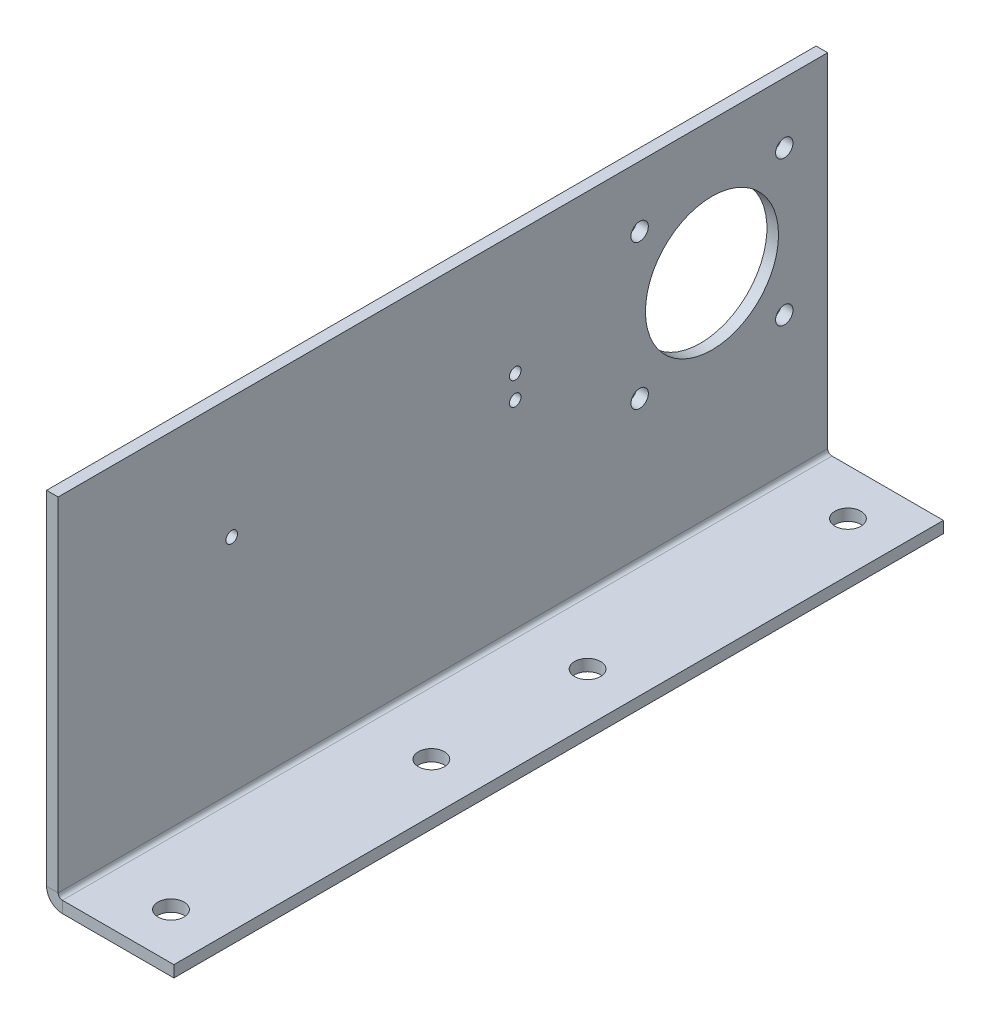
ISO-10303-21;
HEADER;
FILE_DESCRIPTION(('STEP AP214'),'2;1');
FILE_NAME('part.step','',(''),(''),'','','');
FILE_SCHEMA(('AUTOMOTIVE_DESIGN { 1 0 10303 214 1 1 1 1 }'));
ENDSEC;
DATA;
#1=APPLICATION_CONTEXT('core data for automotive mechanical design processes');
#2=APPLICATION_PROTOCOL_DEFINITION('international standard','automotive_design',2000,#1);
#3=PRODUCT_CONTEXT('',#1,'mechanical');
#4=PRODUCT('Part','Part','',(#3));
#5=PRODUCT_RELATED_PRODUCT_CATEGORY('part','',(#4));
#6=PRODUCT_DEFINITION_FORMATION('','',#4);
#7=PRODUCT_DEFINITION_CONTEXT('part definition',#1,'design');
#8=PRODUCT_DEFINITION('design','',#6,#7);
#9=PRODUCT_DEFINITION_SHAPE('','',#8);
#10=(LENGTH_UNIT() NAMED_UNIT(*) SI_UNIT(.MILLI.,.METRE.));
#11=(NAMED_UNIT(*) PLANE_ANGLE_UNIT() SI_UNIT($,.RADIAN.));
#12=(NAMED_UNIT(*) SI_UNIT($,.STERADIAN.) SOLID_ANGLE_UNIT());
#13=UNCERTAINTY_MEASURE_WITH_UNIT(LENGTH_MEASURE(1.E-05),#10,'distance_accuracy_value','');
#14=(GEOMETRIC_REPRESENTATION_CONTEXT(3) GLOBAL_UNCERTAINTY_ASSIGNED_CONTEXT((#13)) GLOBAL_UNIT_ASSIGNED_CONTEXT((#10,
#11,#12)) REPRESENTATION_CONTEXT('',''));
#15=CARTESIAN_POINT('',(0.,0.,0.));
#16=DIRECTION('',(0.,0.,1.));
#17=DIRECTION('',(1.,0.,0.));
#18=AXIS2_PLACEMENT_3D('',#15,#16,#17);
#19=CARTESIAN_POINT('',(0.,0.,133.));
#20=DIRECTION('',(1.,0.,0.));
#21=DIRECTION('',(0.,0.,-1.));
#22=AXIS2_PLACEMENT_3D('',#19,#20,#21);
#23=PLANE('',#22);
#24=CARTESIAN_POINT('',(0.,49.5,32.5));
#25=DIRECTION('',(1.,0.,0.));
#26=DIRECTION('',(0.,0.,-1.));
#27=AXIS2_PLACEMENT_3D('',#24,#25,#26);
#28=CIRCLE('',#27,1.5);
#29=CARTESIAN_POINT('',(0.,49.5,31.));
#30=VERTEX_POINT('',#29);
#31=EDGE_CURVE('E310',#30,#30,#28,.T.);
#32=ORIENTED_EDGE('',*,*,#31,.F.);
#33=EDGE_LOOP('',(#32));
#34=FACE_BOUND('',#33,.T.);
#35=CARTESIAN_POINT('',(0.,24.5,32.5));
#36=DIRECTION('',(1.,0.,0.));
#37=DIRECTION('',(0.,0.,-1.));
#38=AXIS2_PLACEMENT_3D('',#35,#36,#37);
#39=CIRCLE('',#38,1.5);
#40=CARTESIAN_POINT('',(0.,24.5,31.));
#41=VERTEX_POINT('',#40);
#42=EDGE_CURVE('E304',#41,#41,#39,.T.);
#43=ORIENTED_EDGE('',*,*,#42,.F.);
#44=EDGE_LOOP('',(#43));
#45=FACE_BOUND('',#44,.T.);
#46=CARTESIAN_POINT('',(0.,49.5,7.49999999999999));
#47=DIRECTION('',(1.,0.,0.));
#48=DIRECTION('',(0.,0.,-1.));
#49=AXIS2_PLACEMENT_3D('',#46,#47,#48);
#50=CIRCLE('',#49,1.5);
#51=CARTESIAN_POINT('',(0.,49.5,5.99999999999998));
#52=VERTEX_POINT('',#51);
#53=EDGE_CURVE('E298',#52,#52,#50,.T.);
#54=ORIENTED_EDGE('',*,*,#53,.F.);
#55=EDGE_LOOP('',(#54));
#56=FACE_BOUND('',#55,.T.);
#57=CARTESIAN_POINT('',(0.,24.5,7.49999999999999));
#58=DIRECTION('',(1.,0.,0.));
#59=DIRECTION('',(0.,0.,-1.));
#60=AXIS2_PLACEMENT_3D('',#57,#58,#59);
#61=CIRCLE('',#60,1.5);
#62=CARTESIAN_POINT('',(0.,24.5,5.99999999999999));
#63=VERTEX_POINT('',#62);
#64=EDGE_CURVE('E290',#63,#63,#61,.T.);
#65=ORIENTED_EDGE('',*,*,#64,.F.);
#66=EDGE_LOOP('',(#65));
#67=FACE_BOUND('',#66,.T.);
#68=CARTESIAN_POINT('',(0.,37.,20.));
#69=DIRECTION('',(1.,0.,0.));
#70=DIRECTION('',(0.,0.,-1.));
#71=AXIS2_PLACEMENT_3D('',#68,#69,#70);
#72=CIRCLE('',#71,11.5);
#73=CARTESIAN_POINT('',(0.,37.,8.49999999999999));
#74=VERTEX_POINT('',#73);
#75=EDGE_CURVE('E286',#74,#74,#72,.F.);
#76=ORIENTED_EDGE('',*,*,#75,.T.);
#77=EDGE_LOOP('',(#76));
#78=FACE_BOUND('',#77,.T.);
#79=DIRECTION('',(0.,-1.,0.));
#80=VECTOR('',#79,1.);
#81=CARTESIAN_POINT('',(0.,0.,0.));
#82=LINE('',#81,#80);
#83=CARTESIAN_POINT('',(0.,60.,0.));
#84=VERTEX_POINT('',#83);
#85=CARTESIAN_POINT('',(0.,0.7366,0.));
#86=VERTEX_POINT('',#85);
#87=EDGE_CURVE('E165',#84,#86,#82,.T.);
#88=ORIENTED_EDGE('',*,*,#87,.F.);
#89=DIRECTION('',(0.,0.,-1.));
#90=VECTOR('',#89,1.);
#91=CARTESIAN_POINT('',(0.,60.,133.));
#92=LINE('',#91,#90);
#93=CARTESIAN_POINT('',(0.,60.,133.));
#94=VERTEX_POINT('',#93);
#95=EDGE_CURVE('E129',#94,#84,#92,.T.);
#96=ORIENTED_EDGE('',*,*,#95,.F.);
#97=DIRECTION('',(0.,-1.,0.));
#98=VECTOR('',#97,1.);
#99=CARTESIAN_POINT('',(0.,0.,133.));
#100=LINE('',#99,#98);
#101=CARTESIAN_POINT('',(0.,0.7366,133.));
#102=VERTEX_POINT('',#101);
#103=EDGE_CURVE('E145',#94,#102,#100,.T.);
#104=ORIENTED_EDGE('',*,*,#103,.T.);
#105=DIRECTION('',(0.,0.,-1.));
#106=VECTOR('',#105,1.);
#107=CARTESIAN_POINT('',(0.,0.7366,133.));
#108=LINE('',#107,#106);
#109=EDGE_CURVE('E176',#102,#86,#108,.T.);
#110=ORIENTED_EDGE('',*,*,#109,.T.);
#111=EDGE_LOOP('',(#88,#96,#104,#110));
#112=FACE_BOUND('',#111,.T.);
#113=CARTESIAN_POINT('',(0.,39.,103.));
#114=DIRECTION('',(1.,0.,0.));
#115=DIRECTION('',(0.,0.,-1.));
#116=AXIS2_PLACEMENT_3D('',#113,#114,#115);
#117=CIRCLE('',#116,0.999999999999998);
#118=CARTESIAN_POINT('',(0.,39.,102.));
#119=VERTEX_POINT('',#118);
#120=EDGE_CURVE('E269',#119,#119,#117,.F.);
#121=ORIENTED_EDGE('',*,*,#120,.T.);
#122=EDGE_LOOP('',(#121));
#123=FACE_BOUND('',#122,.T.);
#124=CARTESIAN_POINT('',(0.,39.,54.));
#125=DIRECTION('',(1.,0.,0.));
#126=DIRECTION('',(0.,0.,-1.));
#127=AXIS2_PLACEMENT_3D('',#124,#125,#126);
#128=CIRCLE('',#127,0.999999999999998);
#129=CARTESIAN_POINT('',(0.,39.,53.));
#130=VERTEX_POINT('',#129);
#131=EDGE_CURVE('E272',#130,#130,#128,.F.);
#132=ORIENTED_EDGE('',*,*,#131,.T.);
#133=EDGE_LOOP('',(#132));
#134=FACE_BOUND('',#133,.T.);
#135=CARTESIAN_POINT('',(0.,35.,54.));
#136=DIRECTION('',(1.,0.,0.));
#137=DIRECTION('',(0.,0.,-1.));
#138=AXIS2_PLACEMENT_3D('',#135,#136,#137);
#139=CIRCLE('',#138,0.999999999999998);
#140=CARTESIAN_POINT('',(0.,35.,53.));
#141=VERTEX_POINT('',#140);
#142=EDGE_CURVE('E283',#141,#141,#139,.T.);
#143=ORIENTED_EDGE('',*,*,#142,.F.);
#144=EDGE_LOOP('',(#143));
#145=FACE_BOUND('',#144,.T.);
#146=ADVANCED_FACE('F48',(#34,#45,#56,#67,#78,#112,#123,#134,#145),#23,.T.);
#147=CARTESIAN_POINT('',(-2.,0.,133.));
#148=DIRECTION('',(1.,0.,0.));
#149=DIRECTION('',(0.,0.,-1.));
#150=AXIS2_PLACEMENT_3D('',#147,#148,#149);
#151=PLANE('',#150);
#152=CARTESIAN_POINT('',(-2.,49.5,32.5));
#153=DIRECTION('',(-1.,0.,0.));
#154=DIRECTION('',(0.,0.,1.));
#155=AXIS2_PLACEMENT_3D('',#152,#153,#154);
#156=CIRCLE('',#155,1.5);
#157=CARTESIAN_POINT('',(-2.,49.5,34.));
#158=VERTEX_POINT('',#157);
#159=EDGE_CURVE('E313',#158,#158,#156,.T.);
#160=ORIENTED_EDGE('',*,*,#159,.F.);
#161=EDGE_LOOP('',(#160));
#162=FACE_BOUND('',#161,.T.);
#163=CARTESIAN_POINT('',(-2.,24.5,32.5));
#164=DIRECTION('',(-1.,0.,0.));
#165=DIRECTION('',(0.,0.,1.));
#166=AXIS2_PLACEMENT_3D('',#163,#164,#165);
#167=CIRCLE('',#166,1.5);
#168=CARTESIAN_POINT('',(-2.,24.5,34.));
#169=VERTEX_POINT('',#168);
#170=EDGE_CURVE('E307',#169,#169,#167,.T.);
#171=ORIENTED_EDGE('',*,*,#170,.F.);
#172=EDGE_LOOP('',(#171));
#173=FACE_BOUND('',#172,.T.);
#174=CARTESIAN_POINT('',(-2.,49.5,7.49999999999999));
#175=DIRECTION('',(-1.,0.,0.));
#176=DIRECTION('',(0.,0.,1.));
#177=AXIS2_PLACEMENT_3D('',#174,#175,#176);
#178=CIRCLE('',#177,1.5);
#179=CARTESIAN_POINT('',(-2.,49.5,8.99999999999999));
#180=VERTEX_POINT('',#179);
#181=EDGE_CURVE('E301',#180,#180,#178,.T.);
#182=ORIENTED_EDGE('',*,*,#181,.F.);
#183=EDGE_LOOP('',(#182));
#184=FACE_BOUND('',#183,.T.);
#185=CARTESIAN_POINT('',(-2.,24.5,7.49999999999999));
#186=DIRECTION('',(-1.,0.,0.));
#187=DIRECTION('',(0.,0.,1.));
#188=AXIS2_PLACEMENT_3D('',#185,#186,#187);
#189=CIRCLE('',#188,1.5);
#190=CARTESIAN_POINT('',(-2.,24.5,8.99999999999998));
#191=VERTEX_POINT('',#190);
#192=EDGE_CURVE('E295',#191,#191,#189,.T.);
#193=ORIENTED_EDGE('',*,*,#192,.F.);
#194=EDGE_LOOP('',(#193));
#195=FACE_BOUND('',#194,.T.);
#196=CARTESIAN_POINT('',(-2.,37.,20.));
#197=DIRECTION('',(-1.,0.,0.));
#198=DIRECTION('',(0.,0.,1.));
#199=AXIS2_PLACEMENT_3D('',#196,#197,#198);
#200=CIRCLE('',#199,11.5);
#201=CARTESIAN_POINT('',(-2.,37.,31.5));
#202=VERTEX_POINT('',#201);
#203=EDGE_CURVE('E287',#202,#202,#200,.T.);
#204=ORIENTED_EDGE('',*,*,#203,.F.);
#205=EDGE_LOOP('',(#204));
#206=FACE_BOUND('',#205,.T.);
#207=DIRECTION('',(0.,1.,0.));
#208=VECTOR('',#207,1.);
#209=CARTESIAN_POINT('',(-2.,0.,0.));
#210=LINE('',#209,#208);
#211=CARTESIAN_POINT('',(-2.,60.,0.));
#212=VERTEX_POINT('',#211);
#213=CARTESIAN_POINT('',(-2.,0.7366,0.));
#214=VERTEX_POINT('',#213);
#215=EDGE_CURVE('E168',#212,#214,#210,.F.);
#216=ORIENTED_EDGE('',*,*,#215,.T.);
#217=DIRECTION('',(0.,0.,-1.));
#218=VECTOR('',#217,1.);
#219=CARTESIAN_POINT('',(-2.,0.7366,133.));
#220=LINE('',#219,#218);
#221=CARTESIAN_POINT('',(-2.,0.7366,133.));
#222=VERTEX_POINT('',#221);
#223=EDGE_CURVE('E130',#222,#214,#220,.T.);
#224=ORIENTED_EDGE('',*,*,#223,.F.);
#225=DIRECTION('',(0.,1.,0.));
#226=VECTOR('',#225,1.);
#227=CARTESIAN_POINT('',(-2.,0.,133.));
#228=LINE('',#227,#226);
#229=CARTESIAN_POINT('',(-2.,60.,133.));
#230=VERTEX_POINT('',#229);
#231=EDGE_CURVE('E134',#230,#222,#228,.F.);
#232=ORIENTED_EDGE('',*,*,#231,.F.);
#233=DIRECTION('',(0.,0.,-1.));
#234=VECTOR('',#233,1.);
#235=CARTESIAN_POINT('',(-2.,60.,133.));
#236=LINE('',#235,#234);
#237=EDGE_CURVE('E121',#230,#212,#236,.T.);
#238=ORIENTED_EDGE('',*,*,#237,.T.);
#239=EDGE_LOOP('',(#216,#224,#232,#238));
#240=FACE_BOUND('',#239,.T.);
#241=CARTESIAN_POINT('',(-2.,39.,103.));
#242=DIRECTION('',(-1.,0.,0.));
#243=DIRECTION('',(0.,0.,1.));
#244=AXIS2_PLACEMENT_3D('',#241,#242,#243);
#245=CIRCLE('',#244,0.999999999999998);
#246=CARTESIAN_POINT('',(-2.,39.,104.));
#247=VERTEX_POINT('',#246);
#248=EDGE_CURVE('E157',#247,#247,#245,.T.);
#249=ORIENTED_EDGE('',*,*,#248,.F.);
#250=EDGE_LOOP('',(#249));
#251=FACE_BOUND('',#250,.T.);
#252=CARTESIAN_POINT('',(-2.,39.,54.));
#253=DIRECTION('',(-1.,0.,0.));
#254=DIRECTION('',(0.,0.,1.));
#255=AXIS2_PLACEMENT_3D('',#252,#253,#254);
#256=CIRCLE('',#255,0.999999999999998);
#257=CARTESIAN_POINT('',(-2.,39.,55.));
#258=VERTEX_POINT('',#257);
#259=EDGE_CURVE('E275',#258,#258,#256,.T.);
#260=ORIENTED_EDGE('',*,*,#259,.F.);
#261=EDGE_LOOP('',(#260));
#262=FACE_BOUND('',#261,.T.);
#263=CARTESIAN_POINT('',(-2.,35.,54.));
#264=DIRECTION('',(-1.,0.,0.));
#265=DIRECTION('',(0.,0.,1.));
#266=AXIS2_PLACEMENT_3D('',#263,#264,#265);
#267=CIRCLE('',#266,0.999999999999998);
#268=CARTESIAN_POINT('',(-2.,35.,55.));
#269=VERTEX_POINT('',#268);
#270=EDGE_CURVE('E278',#269,#269,#267,.F.);
#271=ORIENTED_EDGE('',*,*,#270,.T.);
#272=EDGE_LOOP('',(#271));
#273=FACE_BOUND('',#272,.T.);
#274=ADVANCED_FACE('F135',(#162,#173,#184,#195,#206,#240,#251,#262,#273),#151,.F.);
#275=CARTESIAN_POINT('',(0.7366,0.,133.));
#276=DIRECTION('',(0.,0.,1.));
#277=DIRECTION('',(1.,0.,0.));
#278=AXIS2_PLACEMENT_3D('',#275,#276,#277);
#279=PLANE('',#278);
#280=DIRECTION('',(0.,-1.,0.));
#281=VECTOR('',#280,1.);
#282=CARTESIAN_POINT('',(0.7366,0.,133.));
#283=LINE('',#282,#281);
#284=CARTESIAN_POINT('',(0.7366,0.,133.));
#285=VERTEX_POINT('',#284);
#286=CARTESIAN_POINT('',(0.7366,-2.,133.));
#287=VERTEX_POINT('',#286);
#288=EDGE_CURVE('E13',#285,#287,#283,.T.);
#289=ORIENTED_EDGE('',*,*,#288,.F.);
#290=CARTESIAN_POINT('',(0.7366,0.7366,133.));
#291=DIRECTION('',(0.,0.,-1.));
#292=DIRECTION('',(-1.,0.,0.));
#293=AXIS2_PLACEMENT_3D('',#290,#291,#292);
#294=CIRCLE('',#293,0.7366);
#295=EDGE_CURVE('E147',#102,#285,#294,.F.);
#296=ORIENTED_EDGE('',*,*,#295,.F.);
#297=DIRECTION('',(1.,0.,0.));
#298=VECTOR('',#297,1.);
#299=CARTESIAN_POINT('',(-2.,0.7366,133.));
#300=LINE('',#299,#298);
#301=EDGE_CURVE('E57',#222,#102,#300,.T.);
#302=ORIENTED_EDGE('',*,*,#301,.F.);
#303=CARTESIAN_POINT('',(0.7366,0.7366,133.));
#304=DIRECTION('',(0.,0.,1.));
#305=DIRECTION('',(1.,0.,0.));
#306=AXIS2_PLACEMENT_3D('',#303,#304,#305);
#307=CIRCLE('',#306,2.7366);
#308=EDGE_CURVE('E140',#222,#287,#307,.T.);
#309=ORIENTED_EDGE('',*,*,#308,.T.);
#310=EDGE_LOOP('',(#289,#296,#302,#309));
#311=FACE_BOUND('',#310,.T.);
#312=ADVANCED_FACE('F50',(#311),#279,.T.);
#313=CARTESIAN_POINT('',(-2.,0.7366,133.));
#314=DIRECTION('',(0.,0.,1.));
#315=DIRECTION('',(1.,0.,0.));
#316=AXIS2_PLACEMENT_3D('',#313,#314,#315);
#317=PLANE('',#316);
#318=DIRECTION('',(1.,0.,0.));
#319=VECTOR('',#318,1.);
#320=CARTESIAN_POINT('',(0.,0.,133.));
#321=LINE('',#320,#319);
#322=CARTESIAN_POINT('',(20.,0.,133.));
#323=VERTEX_POINT('',#322);
#324=EDGE_CURVE('E197',#285,#323,#321,.T.);
#325=ORIENTED_EDGE('',*,*,#324,.F.);
#326=ORIENTED_EDGE('',*,*,#288,.T.);
#327=DIRECTION('',(1.,0.,0.));
#328=VECTOR('',#327,1.);
#329=CARTESIAN_POINT('',(0.,-2.,133.));
#330=LINE('',#329,#328);
#331=CARTESIAN_POINT('',(20.,-2.,133.));
#332=VERTEX_POINT('',#331);
#333=EDGE_CURVE('E105',#287,#332,#330,.T.);
#334=ORIENTED_EDGE('',*,*,#333,.T.);
#335=DIRECTION('',(0.,-1.,0.));
#336=VECTOR('',#335,1.);
#337=CARTESIAN_POINT('',(20.,0.,133.));
#338=LINE('',#337,#336);
#339=EDGE_CURVE('E263',#323,#332,#338,.T.);
#340=ORIENTED_EDGE('',*,*,#339,.F.);
#341=EDGE_LOOP('',(#325,#326,#334,#340));
#342=FACE_BOUND('',#341,.T.);
#343=ADVANCED_FACE('F205',(#342),#317,.T.);
#344=CARTESIAN_POINT('',(0.,0.7366,0.));
#345=DIRECTION('',(0.,0.,-1.));
#346=DIRECTION('',(-1.,0.,0.));
#347=AXIS2_PLACEMENT_3D('',#344,#345,#346);
#348=PLANE('',#347);
#349=DIRECTION('',(-1.,0.,0.));
#350=VECTOR('',#349,1.);
#351=CARTESIAN_POINT('',(0.,0.7366,0.));
#352=LINE('',#351,#350);
#353=EDGE_CURVE('E92',#86,#214,#352,.T.);
#354=ORIENTED_EDGE('',*,*,#353,.F.);
#355=CARTESIAN_POINT('',(0.7366,0.7366,0.));
#356=DIRECTION('',(0.,0.,-1.));
#357=DIRECTION('',(-1.,0.,0.));
#358=AXIS2_PLACEMENT_3D('',#355,#356,#357);
#359=CIRCLE('',#358,0.7366);
#360=CARTESIAN_POINT('',(0.7366,0.,0.));
#361=VERTEX_POINT('',#360);
#362=EDGE_CURVE('E163',#86,#361,#359,.F.);
#363=ORIENTED_EDGE('',*,*,#362,.T.);
#364=DIRECTION('',(0.,1.,0.));
#365=VECTOR('',#364,1.);
#366=CARTESIAN_POINT('',(0.7366,-2.,0.));
#367=LINE('',#366,#365);
#368=CARTESIAN_POINT('',(0.7366,-2.,0.));
#369=VERTEX_POINT('',#368);
#370=EDGE_CURVE('E99',#369,#361,#367,.T.);
#371=ORIENTED_EDGE('',*,*,#370,.F.);
#372=CARTESIAN_POINT('',(0.7366,0.7366,0.));
#373=DIRECTION('',(0.,0.,1.));
#374=DIRECTION('',(1.,0.,0.));
#375=AXIS2_PLACEMENT_3D('',#372,#373,#374);
#376=CIRCLE('',#375,2.7366);
#377=EDGE_CURVE('E170',#214,#369,#376,.T.);
#378=ORIENTED_EDGE('',*,*,#377,.F.);
#379=EDGE_LOOP('',(#354,#363,#371,#378));
#380=FACE_BOUND('',#379,.T.);
#381=ADVANCED_FACE('F203',(#380),#348,.T.);
#382=CARTESIAN_POINT('',(0.7366,-2.,0.));
#383=DIRECTION('',(0.,0.,-1.));
#384=DIRECTION('',(-1.,0.,0.));
#385=AXIS2_PLACEMENT_3D('',#382,#383,#384);
#386=PLANE('',#385);
#387=ORIENTED_EDGE('',*,*,#87,.T.);
#388=ORIENTED_EDGE('',*,*,#353,.T.);
#389=ORIENTED_EDGE('',*,*,#215,.F.);
#390=DIRECTION('',(1.,0.,0.));
#391=VECTOR('',#390,1.);
#392=CARTESIAN_POINT('',(-2.,60.,0.));
#393=LINE('',#392,#391);
#394=EDGE_CURVE('E127',#212,#84,#393,.T.);
#395=ORIENTED_EDGE('',*,*,#394,.T.);
#396=EDGE_LOOP('',(#387,#388,#389,#395));
#397=FACE_BOUND('',#396,.T.);
#398=ADVANCED_FACE('F199',(#397),#386,.T.);
#399=CARTESIAN_POINT('',(0.,-2.,133.));
#400=DIRECTION('',(0.,1.,0.));
#401=DIRECTION('',(0.,0.,1.));
#402=AXIS2_PLACEMENT_3D('',#399,#400,#401);
#403=PLANE('',#402);
#404=CARTESIAN_POINT('',(11.5,-2.,8.));
#405=DIRECTION('',(0.,1.,0.));
#406=DIRECTION('',(0.,0.,1.));
#407=AXIS2_PLACEMENT_3D('',#404,#405,#406);
#408=CIRCLE('',#407,2.25);
#409=CARTESIAN_POINT('',(11.5,-2.,10.25));
#410=VERTEX_POINT('',#409);
#411=EDGE_CURVE('E244',#410,#410,#408,.T.);
#412=ORIENTED_EDGE('',*,*,#411,.T.);
#413=EDGE_LOOP('',(#412));
#414=FACE_BOUND('',#413,.T.);
#415=CARTESIAN_POINT('',(11.5,-2.,53.));
#416=DIRECTION('',(0.,1.,0.));
#417=DIRECTION('',(0.,0.,1.));
#418=AXIS2_PLACEMENT_3D('',#415,#416,#417);
#419=CIRCLE('',#418,2.25);
#420=CARTESIAN_POINT('',(11.5,-2.,55.25));
#421=VERTEX_POINT('',#420);
#422=EDGE_CURVE('E248',#421,#421,#419,.T.);
#423=ORIENTED_EDGE('',*,*,#422,.T.);
#424=EDGE_LOOP('',(#423));
#425=FACE_BOUND('',#424,.T.);
#426=CARTESIAN_POINT('',(11.5,-2.,80.));
#427=DIRECTION('',(0.,1.,0.));
#428=DIRECTION('',(0.,0.,1.));
#429=AXIS2_PLACEMENT_3D('',#426,#427,#428);
#430=CIRCLE('',#429,2.25);
#431=CARTESIAN_POINT('',(11.5,-2.,82.25));
#432=VERTEX_POINT('',#431);
#433=EDGE_CURVE('E252',#432,#432,#430,.T.);
#434=ORIENTED_EDGE('',*,*,#433,.T.);
#435=EDGE_LOOP('',(#434));
#436=FACE_BOUND('',#435,.T.);
#437=CARTESIAN_POINT('',(11.5,-2.,125.));
#438=DIRECTION('',(0.,1.,0.));
#439=DIRECTION('',(0.,0.,1.));
#440=AXIS2_PLACEMENT_3D('',#437,#438,#439);
#441=CIRCLE('',#440,2.25);
#442=CARTESIAN_POINT('',(11.5,-2.,127.25));
#443=VERTEX_POINT('',#442);
#444=EDGE_CURVE('E256',#443,#443,#441,.T.);
#445=ORIENTED_EDGE('',*,*,#444,.T.);
#446=EDGE_LOOP('',(#445));
#447=FACE_BOUND('',#446,.T.);
#448=DIRECTION('',(1.,0.,0.));
#449=VECTOR('',#448,1.);
#450=CARTESIAN_POINT('',(0.,-2.,0.));
#451=LINE('',#450,#449);
#452=CARTESIAN_POINT('',(20.,-2.,0.));
#453=VERTEX_POINT('',#452);
#454=EDGE_CURVE('E153',#369,#453,#451,.T.);
#455=ORIENTED_EDGE('',*,*,#454,.T.);
#456=DIRECTION('',(0.,0.,-1.));
#457=VECTOR('',#456,1.);
#458=CARTESIAN_POINT('',(20.,-2.,133.));
#459=LINE('',#458,#457);
#460=EDGE_CURVE('E184',#332,#453,#459,.T.);
#461=ORIENTED_EDGE('',*,*,#460,.F.);
#462=ORIENTED_EDGE('',*,*,#333,.F.);
#463=DIRECTION('',(0.,0.,-1.));
#464=VECTOR('',#463,1.);
#465=CARTESIAN_POINT('',(0.7366,-2.,133.));
#466=LINE('',#465,#464);
#467=EDGE_CURVE('E152',#287,#369,#466,.T.);
#468=ORIENTED_EDGE('',*,*,#467,.T.);
#469=EDGE_LOOP('',(#455,#461,#462,#468));
#470=FACE_BOUND('',#469,.T.);
#471=ADVANCED_FACE('F211',(#414,#425,#436,#447,#470),#403,.F.);
#472=CARTESIAN_POINT('',(20.,0.,133.));
#473=DIRECTION('',(1.,0.,0.));
#474=DIRECTION('',(0.,0.,-1.));
#475=AXIS2_PLACEMENT_3D('',#472,#473,#474);
#476=PLANE('',#475);
#477=DIRECTION('',(0.,-1.,0.));
#478=VECTOR('',#477,1.);
#479=CARTESIAN_POINT('',(20.,0.,0.));
#480=LINE('',#479,#478);
#481=CARTESIAN_POINT('',(20.,0.,0.));
#482=VERTEX_POINT('',#481);
#483=EDGE_CURVE('E156',#482,#453,#480,.T.);
#484=ORIENTED_EDGE('',*,*,#483,.F.);
#485=DIRECTION('',(0.,0.,-1.));
#486=VECTOR('',#485,1.);
#487=CARTESIAN_POINT('',(20.,0.,133.));
#488=LINE('',#487,#486);
#489=EDGE_CURVE('E182',#323,#482,#488,.T.);
#490=ORIENTED_EDGE('',*,*,#489,.F.);
#491=ORIENTED_EDGE('',*,*,#339,.T.);
#492=ORIENTED_EDGE('',*,*,#460,.T.);
#493=EDGE_LOOP('',(#484,#490,#491,#492));
#494=FACE_BOUND('',#493,.T.);
#495=ADVANCED_FACE('F231',(#494),#476,.T.);
#496=CARTESIAN_POINT('',(0.,0.,133.));
#497=DIRECTION('',(0.,1.,0.));
#498=DIRECTION('',(0.,0.,1.));
#499=AXIS2_PLACEMENT_3D('',#496,#497,#498);
#500=PLANE('',#499);
#501=CARTESIAN_POINT('',(11.5,0.,8.));
#502=DIRECTION('',(0.,1.,0.));
#503=DIRECTION('',(0.,0.,1.));
#504=AXIS2_PLACEMENT_3D('',#501,#502,#503);
#505=CIRCLE('',#504,2.25);
#506=CARTESIAN_POINT('',(11.5,0.,10.25));
#507=VERTEX_POINT('',#506);
#508=EDGE_CURVE('E328',#507,#507,#505,.T.);
#509=ORIENTED_EDGE('',*,*,#508,.F.);
#510=EDGE_LOOP('',(#509));
#511=FACE_BOUND('',#510,.T.);
#512=CARTESIAN_POINT('',(11.5,0.,53.));
#513=DIRECTION('',(0.,1.,0.));
#514=DIRECTION('',(0.,0.,1.));
#515=AXIS2_PLACEMENT_3D('',#512,#513,#514);
#516=CIRCLE('',#515,2.25);
#517=CARTESIAN_POINT('',(11.5,0.,55.25));
#518=VERTEX_POINT('',#517);
#519=EDGE_CURVE('E324',#518,#518,#516,.T.);
#520=ORIENTED_EDGE('',*,*,#519,.F.);
#521=EDGE_LOOP('',(#520));
#522=FACE_BOUND('',#521,.T.);
#523=CARTESIAN_POINT('',(11.5,0.,80.));
#524=DIRECTION('',(0.,1.,0.));
#525=DIRECTION('',(0.,0.,1.));
#526=AXIS2_PLACEMENT_3D('',#523,#524,#525);
#527=CIRCLE('',#526,2.25);
#528=CARTESIAN_POINT('',(11.5,0.,82.25));
#529=VERTEX_POINT('',#528);
#530=EDGE_CURVE('E320',#529,#529,#527,.T.);
#531=ORIENTED_EDGE('',*,*,#530,.F.);
#532=EDGE_LOOP('',(#531));
#533=FACE_BOUND('',#532,.T.);
#534=CARTESIAN_POINT('',(11.5,0.,125.));
#535=DIRECTION('',(0.,1.,0.));
#536=DIRECTION('',(0.,0.,1.));
#537=AXIS2_PLACEMENT_3D('',#534,#535,#536);
#538=CIRCLE('',#537,2.25);
#539=CARTESIAN_POINT('',(11.5,0.,127.25));
#540=VERTEX_POINT('',#539);
#541=EDGE_CURVE('E316',#540,#540,#538,.T.);
#542=ORIENTED_EDGE('',*,*,#541,.F.);
#543=EDGE_LOOP('',(#542));
#544=FACE_BOUND('',#543,.T.);
#545=DIRECTION('',(1.,0.,0.));
#546=VECTOR('',#545,1.);
#547=CARTESIAN_POINT('',(0.,0.,0.));
#548=LINE('',#547,#546);
#549=EDGE_CURVE('E160',#361,#482,#548,.T.);
#550=ORIENTED_EDGE('',*,*,#549,.F.);
#551=DIRECTION('',(0.,0.,-1.));
#552=VECTOR('',#551,1.);
#553=CARTESIAN_POINT('',(0.7366,0.,133.));
#554=LINE('',#553,#552);
#555=EDGE_CURVE('E179',#285,#361,#554,.T.);
#556=ORIENTED_EDGE('',*,*,#555,.F.);
#557=ORIENTED_EDGE('',*,*,#324,.T.);
#558=ORIENTED_EDGE('',*,*,#489,.T.);
#559=EDGE_LOOP('',(#550,#556,#557,#558));
#560=FACE_BOUND('',#559,.T.);
#561=ADVANCED_FACE('F228',(#511,#522,#533,#544,#560),#500,.T.);
#562=CARTESIAN_POINT('',(0.7366,0.7366,133.));
#563=DIRECTION('',(0.,0.,-1.));
#564=DIRECTION('',(-1.,0.,0.));
#565=AXIS2_PLACEMENT_3D('',#562,#563,#564);
#566=CYLINDRICAL_SURFACE('',#565,0.7366);
#567=ORIENTED_EDGE('',*,*,#362,.F.);
#568=ORIENTED_EDGE('',*,*,#109,.F.);
#569=ORIENTED_EDGE('',*,*,#295,.T.);
#570=ORIENTED_EDGE('',*,*,#555,.T.);
#571=EDGE_LOOP('',(#567,#568,#569,#570));
#572=FACE_BOUND('',#571,.T.);
#573=ADVANCED_FACE('F193',(#572),#566,.F.);
#574=CARTESIAN_POINT('',(-2.,60.,133.));
#575=DIRECTION('',(0.,1.,0.));
#576=DIRECTION('',(0.,0.,1.));
#577=AXIS2_PLACEMENT_3D('',#574,#575,#576);
#578=PLANE('',#577);
#579=ORIENTED_EDGE('',*,*,#394,.F.);
#580=ORIENTED_EDGE('',*,*,#237,.F.);
#581=DIRECTION('',(1.,0.,0.));
#582=VECTOR('',#581,1.);
#583=CARTESIAN_POINT('',(-2.,60.,133.));
#584=LINE('',#583,#582);
#585=EDGE_CURVE('E125',#230,#94,#584,.T.);
#586=ORIENTED_EDGE('',*,*,#585,.T.);
#587=ORIENTED_EDGE('',*,*,#95,.T.);
#588=EDGE_LOOP('',(#579,#580,#586,#587));
#589=FACE_BOUND('',#588,.T.);
#590=ADVANCED_FACE('F123',(#589),#578,.T.);
#591=CARTESIAN_POINT('',(0.7366,0.7366,133.));
#592=DIRECTION('',(0.,0.,-1.));
#593=DIRECTION('',(-1.,0.,0.));
#594=AXIS2_PLACEMENT_3D('',#591,#592,#593);
#595=CYLINDRICAL_SURFACE('',#594,2.7366);
#596=ORIENTED_EDGE('',*,*,#377,.T.);
#597=ORIENTED_EDGE('',*,*,#467,.F.);
#598=ORIENTED_EDGE('',*,*,#308,.F.);
#599=ORIENTED_EDGE('',*,*,#223,.T.);
#600=EDGE_LOOP('',(#596,#597,#598,#599));
#601=FACE_BOUND('',#600,.T.);
#602=ADVANCED_FACE('F201',(#601),#595,.T.);
#603=CARTESIAN_POINT('',(0.7366,0.7366,133.));
#604=DIRECTION('',(0.,0.,-1.));
#605=DIRECTION('',(-1.,0.,0.));
#606=AXIS2_PLACEMENT_3D('',#603,#604,#605);
#607=PLANE('',#606);
#608=ORIENTED_EDGE('',*,*,#231,.T.);
#609=ORIENTED_EDGE('',*,*,#301,.T.);
#610=ORIENTED_EDGE('',*,*,#103,.F.);
#611=ORIENTED_EDGE('',*,*,#585,.F.);
#612=EDGE_LOOP('',(#608,#609,#610,#611));
#613=FACE_BOUND('',#612,.T.);
#614=ADVANCED_FACE('F143',(#613),#607,.F.);
#615=CARTESIAN_POINT('',(0.7366,0.7366,0.));
#616=DIRECTION('',(0.,0.,-1.));
#617=DIRECTION('',(-1.,0.,0.));
#618=AXIS2_PLACEMENT_3D('',#615,#616,#617);
#619=PLANE('',#618);
#620=ORIENTED_EDGE('',*,*,#454,.F.);
#621=ORIENTED_EDGE('',*,*,#370,.T.);
#622=ORIENTED_EDGE('',*,*,#549,.T.);
#623=ORIENTED_EDGE('',*,*,#483,.T.);
#624=EDGE_LOOP('',(#620,#621,#622,#623));
#625=FACE_BOUND('',#624,.T.);
#626=ADVANCED_FACE('F261',(#625),#619,.T.);
#627=CARTESIAN_POINT('',(20.001,39.,103.));
#628=DIRECTION('',(-1.,0.,0.));
#629=DIRECTION('',(0.,0.,1.));
#630=AXIS2_PLACEMENT_3D('',#627,#628,#629);
#631=CYLINDRICAL_SURFACE('',#630,0.999999999999998);
#632=ORIENTED_EDGE('',*,*,#120,.F.);
#633=EDGE_LOOP('',(#632));
#634=FACE_BOUND('',#633,.T.);
#635=ORIENTED_EDGE('',*,*,#248,.T.);
#636=EDGE_LOOP('',(#635));
#637=FACE_BOUND('',#636,.T.);
#638=ADVANCED_FACE('F382',(#634,#637),#631,.F.);
#639=CARTESIAN_POINT('',(20.001,39.,54.));
#640=DIRECTION('',(-1.,0.,0.));
#641=DIRECTION('',(0.,0.,1.));
#642=AXIS2_PLACEMENT_3D('',#639,#640,#641);
#643=CYLINDRICAL_SURFACE('',#642,0.999999999999998);
#644=ORIENTED_EDGE('',*,*,#131,.F.);
#645=EDGE_LOOP('',(#644));
#646=FACE_BOUND('',#645,.T.);
#647=ORIENTED_EDGE('',*,*,#259,.T.);
#648=EDGE_LOOP('',(#647));
#649=FACE_BOUND('',#648,.T.);
#650=ADVANCED_FACE('F378',(#646,#649),#643,.F.);
#651=CARTESIAN_POINT('',(20.001,35.,54.));
#652=DIRECTION('',(-1.,0.,0.));
#653=DIRECTION('',(0.,0.,1.));
#654=AXIS2_PLACEMENT_3D('',#651,#652,#653);
#655=CYLINDRICAL_SURFACE('',#654,0.999999999999998);
#656=ORIENTED_EDGE('',*,*,#142,.T.);
#657=EDGE_LOOP('',(#656));
#658=FACE_BOUND('',#657,.T.);
#659=ORIENTED_EDGE('',*,*,#270,.F.);
#660=EDGE_LOOP('',(#659));
#661=FACE_BOUND('',#660,.T.);
#662=ADVANCED_FACE('F374',(#658,#661),#655,.F.);
#663=CARTESIAN_POINT('',(20.001,37.,20.));
#664=DIRECTION('',(-1.,0.,0.));
#665=DIRECTION('',(0.,0.,1.));
#666=AXIS2_PLACEMENT_3D('',#663,#664,#665);
#667=CYLINDRICAL_SURFACE('',#666,11.5);
#668=ORIENTED_EDGE('',*,*,#75,.F.);
#669=EDGE_LOOP('',(#668));
#670=FACE_BOUND('',#669,.T.);
#671=ORIENTED_EDGE('',*,*,#203,.T.);
#672=EDGE_LOOP('',(#671));
#673=FACE_BOUND('',#672,.T.);
#674=ADVANCED_FACE('F370',(#670,#673),#667,.F.);
#675=CARTESIAN_POINT('',(-2.,24.5,7.49999999999999));
#676=DIRECTION('',(-1.,0.,0.));
#677=DIRECTION('',(0.,0.,1.));
#678=AXIS2_PLACEMENT_3D('',#675,#676,#677);
#679=CYLINDRICAL_SURFACE('',#678,1.5);
#680=ORIENTED_EDGE('',*,*,#64,.T.);
#681=EDGE_LOOP('',(#680));
#682=FACE_BOUND('',#681,.T.);
#683=ORIENTED_EDGE('',*,*,#192,.T.);
#684=EDGE_LOOP('',(#683));
#685=FACE_BOUND('',#684,.T.);
#686=ADVANCED_FACE('F366',(#682,#685),#679,.F.);
#687=CARTESIAN_POINT('',(-2.,49.5,7.49999999999999));
#688=DIRECTION('',(-1.,0.,0.));
#689=DIRECTION('',(0.,0.,1.));
#690=AXIS2_PLACEMENT_3D('',#687,#688,#689);
#691=CYLINDRICAL_SURFACE('',#690,1.5);
#692=ORIENTED_EDGE('',*,*,#53,.T.);
#693=EDGE_LOOP('',(#692));
#694=FACE_BOUND('',#693,.T.);
#695=ORIENTED_EDGE('',*,*,#181,.T.);
#696=EDGE_LOOP('',(#695));
#697=FACE_BOUND('',#696,.T.);
#698=ADVANCED_FACE('F362',(#694,#697),#691,.F.);
#699=CARTESIAN_POINT('',(-2.,24.5,32.5));
#700=DIRECTION('',(-1.,0.,0.));
#701=DIRECTION('',(0.,0.,1.));
#702=AXIS2_PLACEMENT_3D('',#699,#700,#701);
#703=CYLINDRICAL_SURFACE('',#702,1.5);
#704=ORIENTED_EDGE('',*,*,#42,.T.);
#705=EDGE_LOOP('',(#704));
#706=FACE_BOUND('',#705,.T.);
#707=ORIENTED_EDGE('',*,*,#170,.T.);
#708=EDGE_LOOP('',(#707));
#709=FACE_BOUND('',#708,.T.);
#710=ADVANCED_FACE('F355',(#706,#709),#703,.F.);
#711=CARTESIAN_POINT('',(-2.,49.5,32.5));
#712=DIRECTION('',(-1.,0.,0.));
#713=DIRECTION('',(0.,0.,1.));
#714=AXIS2_PLACEMENT_3D('',#711,#712,#713);
#715=CYLINDRICAL_SURFACE('',#714,1.5);
#716=ORIENTED_EDGE('',*,*,#31,.T.);
#717=EDGE_LOOP('',(#716));
#718=FACE_BOUND('',#717,.T.);
#719=ORIENTED_EDGE('',*,*,#159,.T.);
#720=EDGE_LOOP('',(#719));
#721=FACE_BOUND('',#720,.T.);
#722=ADVANCED_FACE('F345',(#718,#721),#715,.F.);
#723=CARTESIAN_POINT('',(11.5,-2.,125.));
#724=DIRECTION('',(0.,1.,0.));
#725=DIRECTION('',(0.,0.,1.));
#726=AXIS2_PLACEMENT_3D('',#723,#724,#725);
#727=CYLINDRICAL_SURFACE('',#726,2.25);
#728=ORIENTED_EDGE('',*,*,#444,.F.);
#729=EDGE_LOOP('',(#728));
#730=FACE_BOUND('',#729,.T.);
#731=ORIENTED_EDGE('',*,*,#541,.T.);
#732=EDGE_LOOP('',(#731));
#733=FACE_BOUND('',#732,.T.);
#734=ADVANCED_FACE('F342',(#730,#733),#727,.F.);
#735=CARTESIAN_POINT('',(11.5,-2.,80.));
#736=DIRECTION('',(0.,1.,0.));
#737=DIRECTION('',(0.,0.,1.));
#738=AXIS2_PLACEMENT_3D('',#735,#736,#737);
#739=CYLINDRICAL_SURFACE('',#738,2.25);
#740=ORIENTED_EDGE('',*,*,#433,.F.);
#741=EDGE_LOOP('',(#740));
#742=FACE_BOUND('',#741,.T.);
#743=ORIENTED_EDGE('',*,*,#530,.T.);
#744=EDGE_LOOP('',(#743));
#745=FACE_BOUND('',#744,.T.);
#746=ADVANCED_FACE('F344',(#742,#745),#739,.F.);
#747=CARTESIAN_POINT('',(11.5,-2.,53.));
#748=DIRECTION('',(0.,1.,0.));
#749=DIRECTION('',(0.,0.,1.));
#750=AXIS2_PLACEMENT_3D('',#747,#748,#749);
#751=CYLINDRICAL_SURFACE('',#750,2.25);
#752=ORIENTED_EDGE('',*,*,#422,.F.);
#753=EDGE_LOOP('',(#752));
#754=FACE_BOUND('',#753,.T.);
#755=ORIENTED_EDGE('',*,*,#519,.T.);
#756=EDGE_LOOP('',(#755));
#757=FACE_BOUND('',#756,.T.);
#758=ADVANCED_FACE('F352',(#754,#757),#751,.F.);
#759=CARTESIAN_POINT('',(11.5,-2.,8.));
#760=DIRECTION('',(0.,1.,0.));
#761=DIRECTION('',(0.,0.,1.));
#762=AXIS2_PLACEMENT_3D('',#759,#760,#761);
#763=CYLINDRICAL_SURFACE('',#762,2.25);
#764=ORIENTED_EDGE('',*,*,#411,.F.);
#765=EDGE_LOOP('',(#764));
#766=FACE_BOUND('',#765,.T.);
#767=ORIENTED_EDGE('',*,*,#508,.T.);
#768=EDGE_LOOP('',(#767));
#769=FACE_BOUND('',#768,.T.);
#770=ADVANCED_FACE('F333',(#766,#769),#763,.F.);
#771=CLOSED_SHELL('',(#146,#274,#312,#343,#381,#398,#471,#495,#561,#573,#590,#602,#614,#626,
#638,#650,#662,#674,#686,#698,#710,#722,#734,#746,#758,#770));
#772=MANIFOLD_SOLID_BREP('B2',#771);
#773=ADVANCED_BREP_SHAPE_REPRESENTATION('',(#18,#772),#14);
#774=SHAPE_DEFINITION_REPRESENTATION(#9,#773);
ENDSEC;
END-ISO-10303-21;
